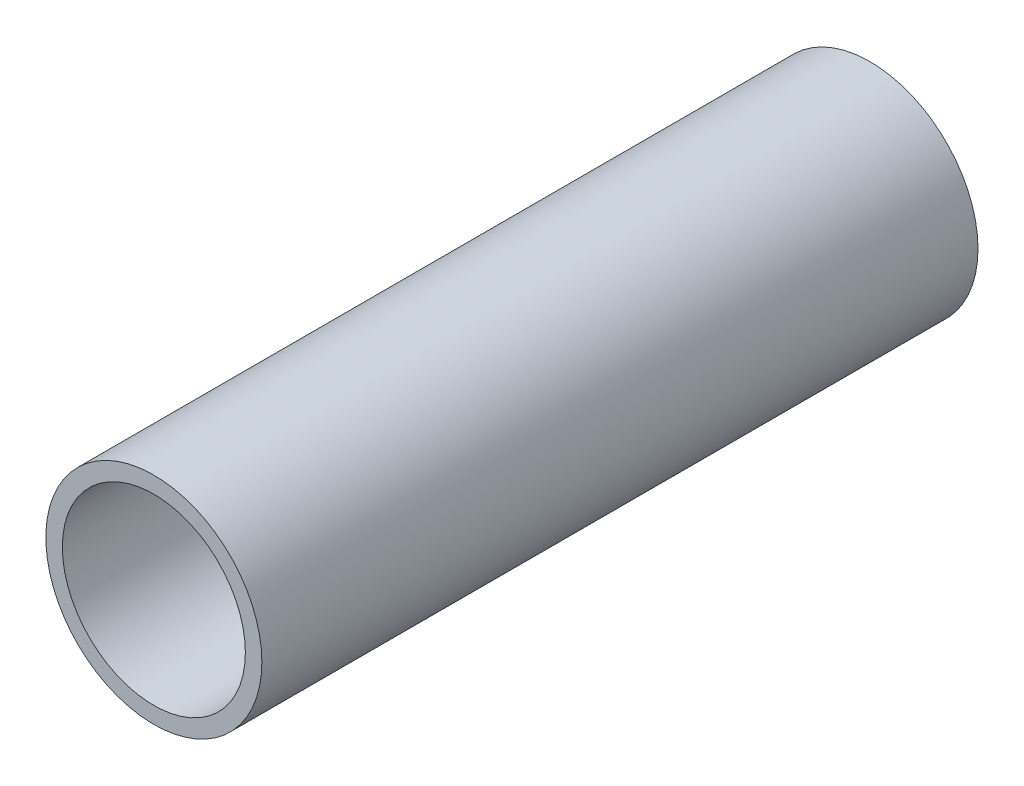
ISO-10303-21;
HEADER;
FILE_DESCRIPTION(('STEP AP214'),'2;1');
FILE_NAME('part.step','',(''),(''),'','','');
FILE_SCHEMA(('AUTOMOTIVE_DESIGN { 1 0 10303 214 1 1 1 1 }'));
ENDSEC;
DATA;
#1=APPLICATION_CONTEXT('core data for automotive mechanical design processes');
#2=APPLICATION_PROTOCOL_DEFINITION('international standard','automotive_design',2000,#1);
#3=PRODUCT_CONTEXT('',#1,'mechanical');
#4=PRODUCT('Part','Part','',(#3));
#5=PRODUCT_RELATED_PRODUCT_CATEGORY('part','',(#4));
#6=PRODUCT_DEFINITION_FORMATION('','',#4);
#7=PRODUCT_DEFINITION_CONTEXT('part definition',#1,'design');
#8=PRODUCT_DEFINITION('design','',#6,#7);
#9=PRODUCT_DEFINITION_SHAPE('','',#8);
#10=(LENGTH_UNIT() NAMED_UNIT(*) SI_UNIT(.MILLI.,.METRE.));
#11=(NAMED_UNIT(*) PLANE_ANGLE_UNIT() SI_UNIT($,.RADIAN.));
#12=(NAMED_UNIT(*) SI_UNIT($,.STERADIAN.) SOLID_ANGLE_UNIT());
#13=UNCERTAINTY_MEASURE_WITH_UNIT(LENGTH_MEASURE(1.E-05),#10,'distance_accuracy_value','');
#14=(GEOMETRIC_REPRESENTATION_CONTEXT(3) GLOBAL_UNCERTAINTY_ASSIGNED_CONTEXT((#13)) GLOBAL_UNIT_ASSIGNED_CONTEXT((#10,
#11,#12)) REPRESENTATION_CONTEXT('',''));
#15=CARTESIAN_POINT('',(0.,0.,0.));
#16=DIRECTION('',(0.,0.,1.));
#17=DIRECTION('',(1.,0.,0.));
#18=AXIS2_PLACEMENT_3D('',#15,#16,#17);
#19=CARTESIAN_POINT('',(0.,0.,80.));
#20=DIRECTION('',(0.,0.,1.));
#21=DIRECTION('',(1.,0.,0.));
#22=AXIS2_PLACEMENT_3D('',#19,#20,#21);
#23=PLANE('',#22);
#24=CARTESIAN_POINT('',(0.,0.,80.));
#25=DIRECTION('',(0.,0.,1.));
#26=DIRECTION('',(1.,0.,0.));
#27=AXIS2_PLACEMENT_3D('',#24,#25,#26);
#28=CIRCLE('',#27,24.13);
#29=CARTESIAN_POINT('',(24.13,0.,80.));
#30=VERTEX_POINT('',#29);
#31=EDGE_CURVE('E11',#30,#30,#28,.T.);
#32=ORIENTED_EDGE('',*,*,#31,.T.);
#33=EDGE_LOOP('',(#32));
#34=FACE_BOUND('',#33,.T.);
#35=CARTESIAN_POINT('',(0.,0.,80.));
#36=DIRECTION('',(0.,0.,1.));
#37=DIRECTION('',(1.,0.,0.));
#38=AXIS2_PLACEMENT_3D('',#35,#36,#37);
#39=CIRCLE('',#38,20.447);
#40=CARTESIAN_POINT('',(20.447,0.,80.));
#41=VERTEX_POINT('',#40);
#42=EDGE_CURVE('E47',#41,#41,#39,.T.);
#43=ORIENTED_EDGE('',*,*,#42,.F.);
#44=EDGE_LOOP('',(#43));
#45=FACE_BOUND('',#44,.T.);
#46=ADVANCED_FACE('F36',(#34,#45),#23,.T.);
#47=CARTESIAN_POINT('',(0.,0.,-80.));
#48=DIRECTION('',(0.,0.,1.));
#49=DIRECTION('',(1.,0.,0.));
#50=AXIS2_PLACEMENT_3D('',#47,#48,#49);
#51=PLANE('',#50);
#52=CARTESIAN_POINT('',(0.,0.,-80.));
#53=DIRECTION('',(0.,0.,1.));
#54=DIRECTION('',(1.,0.,0.));
#55=AXIS2_PLACEMENT_3D('',#52,#53,#54);
#56=CIRCLE('',#55,24.13);
#57=CARTESIAN_POINT('',(24.13,0.,-80.));
#58=VERTEX_POINT('',#57);
#59=EDGE_CURVE('E40',#58,#58,#56,.T.);
#60=ORIENTED_EDGE('',*,*,#59,.F.);
#61=EDGE_LOOP('',(#60));
#62=FACE_BOUND('',#61,.T.);
#63=CARTESIAN_POINT('',(0.,0.,-80.));
#64=DIRECTION('',(0.,0.,1.));
#65=DIRECTION('',(1.,0.,0.));
#66=AXIS2_PLACEMENT_3D('',#63,#64,#65);
#67=CIRCLE('',#66,20.447);
#68=CARTESIAN_POINT('',(20.447,0.,-80.));
#69=VERTEX_POINT('',#68);
#70=EDGE_CURVE('E49',#69,#69,#67,.T.);
#71=ORIENTED_EDGE('',*,*,#70,.T.);
#72=EDGE_LOOP('',(#71));
#73=FACE_BOUND('',#72,.T.);
#74=ADVANCED_FACE('F59',(#62,#73),#51,.F.);
#75=CARTESIAN_POINT('',(0.,0.,80.));
#76=DIRECTION('',(0.,0.,-1.));
#77=DIRECTION('',(-1.,0.,0.));
#78=AXIS2_PLACEMENT_3D('',#75,#76,#77);
#79=CYLINDRICAL_SURFACE('',#78,24.13);
#80=ORIENTED_EDGE('',*,*,#31,.F.);
#81=EDGE_LOOP('',(#80));
#82=FACE_BOUND('',#81,.T.);
#83=ORIENTED_EDGE('',*,*,#59,.T.);
#84=EDGE_LOOP('',(#83));
#85=FACE_BOUND('',#84,.T.);
#86=ADVANCED_FACE('F38',(#82,#85),#79,.T.);
#87=CARTESIAN_POINT('',(0.,0.,80.));
#88=DIRECTION('',(0.,0.,-1.));
#89=DIRECTION('',(-1.,0.,0.));
#90=AXIS2_PLACEMENT_3D('',#87,#88,#89);
#91=CYLINDRICAL_SURFACE('',#90,20.447);
#92=ORIENTED_EDGE('',*,*,#42,.T.);
#93=EDGE_LOOP('',(#92));
#94=FACE_BOUND('',#93,.T.);
#95=ORIENTED_EDGE('',*,*,#70,.F.);
#96=EDGE_LOOP('',(#95));
#97=FACE_BOUND('',#96,.T.);
#98=ADVANCED_FACE('F55',(#94,#97),#91,.F.);
#99=CLOSED_SHELL('',(#46,#74,#86,#98));
#100=MANIFOLD_SOLID_BREP('B2',#99);
#101=ADVANCED_BREP_SHAPE_REPRESENTATION('',(#18,#100),#14);
#102=SHAPE_DEFINITION_REPRESENTATION(#9,#101);
ENDSEC;
END-ISO-10303-21;
